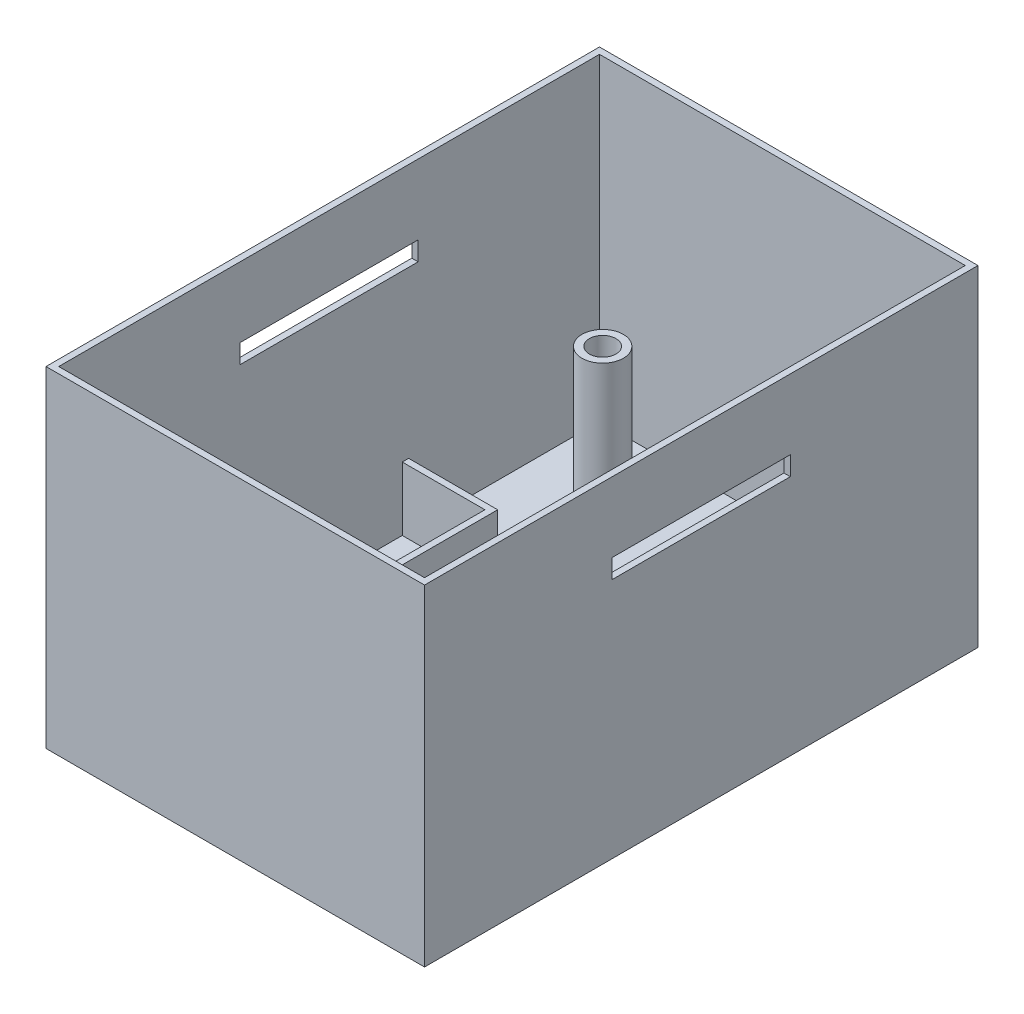
ISO-10303-21;
HEADER;
FILE_DESCRIPTION(('STEP AP214'),'2;1');
FILE_NAME('part.step','',(''),(''),'','','');
FILE_SCHEMA(('AUTOMOTIVE_DESIGN { 1 0 10303 214 1 1 1 1 }'));
ENDSEC;
DATA;
#1=APPLICATION_CONTEXT('core data for automotive mechanical design processes');
#2=APPLICATION_PROTOCOL_DEFINITION('international standard','automotive_design',2000,#1);
#3=PRODUCT_CONTEXT('',#1,'mechanical');
#4=PRODUCT('Part','Part','',(#3));
#5=PRODUCT_RELATED_PRODUCT_CATEGORY('part','',(#4));
#6=PRODUCT_DEFINITION_FORMATION('','',#4);
#7=PRODUCT_DEFINITION_CONTEXT('part definition',#1,'design');
#8=PRODUCT_DEFINITION('design','',#6,#7);
#9=PRODUCT_DEFINITION_SHAPE('','',#8);
#10=(LENGTH_UNIT() NAMED_UNIT(*) SI_UNIT(.MILLI.,.METRE.));
#11=(NAMED_UNIT(*) PLANE_ANGLE_UNIT() SI_UNIT($,.RADIAN.));
#12=(NAMED_UNIT(*) SI_UNIT($,.STERADIAN.) SOLID_ANGLE_UNIT());
#13=UNCERTAINTY_MEASURE_WITH_UNIT(LENGTH_MEASURE(1.E-05),#10,'distance_accuracy_value','');
#14=(GEOMETRIC_REPRESENTATION_CONTEXT(3) GLOBAL_UNCERTAINTY_ASSIGNED_CONTEXT((#13)) GLOBAL_UNIT_ASSIGNED_CONTEXT((#10,
#11,#12)) REPRESENTATION_CONTEXT('',''));
#15=CARTESIAN_POINT('',(0.,0.,0.));
#16=DIRECTION('',(0.,0.,1.));
#17=DIRECTION('',(1.,0.,0.));
#18=AXIS2_PLACEMENT_3D('',#15,#16,#17);
#19=CARTESIAN_POINT('',(-28.75,50.,0.));
#20=DIRECTION('',(-1.,0.,0.));
#21=DIRECTION('',(0.,0.,1.));
#22=AXIS2_PLACEMENT_3D('',#19,#20,#21);
#23=PLANE('',#22);
#24=DIRECTION('',(0.,1.,0.));
#25=VECTOR('',#24,1.);
#26=CARTESIAN_POINT('',(-28.75,50.,14.));
#27=LINE('',#26,#25);
#28=CARTESIAN_POINT('',(-28.75,36.,14.));
#29=VERTEX_POINT('',#28);
#30=CARTESIAN_POINT('',(-28.75,39.,14.));
#31=VERTEX_POINT('',#30);
#32=EDGE_CURVE('E258',#29,#31,#27,.T.);
#33=ORIENTED_EDGE('',*,*,#32,.T.);
#34=DIRECTION('',(0.,0.,-1.));
#35=VECTOR('',#34,1.);
#36=CARTESIAN_POINT('',(-28.75,39.,0.));
#37=LINE('',#36,#35);
#38=CARTESIAN_POINT('',(-28.75,39.,-14.));
#39=VERTEX_POINT('',#38);
#40=EDGE_CURVE('E264',#31,#39,#37,.T.);
#41=ORIENTED_EDGE('',*,*,#40,.T.);
#42=DIRECTION('',(0.,-1.,0.));
#43=VECTOR('',#42,1.);
#44=CARTESIAN_POINT('',(-28.75,50.,-14.));
#45=LINE('',#44,#43);
#46=CARTESIAN_POINT('',(-28.75,36.,-14.));
#47=VERTEX_POINT('',#46);
#48=EDGE_CURVE('E249',#39,#47,#45,.T.);
#49=ORIENTED_EDGE('',*,*,#48,.T.);
#50=DIRECTION('',(0.,0.,1.));
#51=VECTOR('',#50,1.);
#52=CARTESIAN_POINT('',(-28.75,36.,0.));
#53=LINE('',#52,#51);
#54=EDGE_CURVE('E220',#47,#29,#53,.T.);
#55=ORIENTED_EDGE('',*,*,#54,.T.);
#56=EDGE_LOOP('',(#33,#41,#49,#55));
#57=FACE_BOUND('',#56,.T.);
#58=DIRECTION('',(0.,-1.,0.));
#59=VECTOR('',#58,1.);
#60=CARTESIAN_POINT('',(-28.75,10.,34.5));
#61=LINE('',#60,#59);
#62=CARTESIAN_POINT('',(-28.75,10.,34.5));
#63=VERTEX_POINT('',#62);
#64=CARTESIAN_POINT('',(-28.75,0.,34.5));
#65=VERTEX_POINT('',#64);
#66=EDGE_CURVE('E347',#63,#65,#61,.T.);
#67=ORIENTED_EDGE('',*,*,#66,.T.);
#68=DIRECTION('',(0.,0.,-1.));
#69=VECTOR('',#68,1.);
#70=CARTESIAN_POINT('',(-28.75,0.,0.));
#71=LINE('',#70,#69);
#72=CARTESIAN_POINT('',(-28.75,0.,-11.5));
#73=VERTEX_POINT('',#72);
#74=EDGE_CURVE('E385',#65,#73,#71,.T.);
#75=ORIENTED_EDGE('',*,*,#74,.T.);
#76=DIRECTION('',(0.,-1.,0.));
#77=VECTOR('',#76,1.);
#78=CARTESIAN_POINT('',(-28.75,10.,-11.5));
#79=LINE('',#78,#77);
#80=CARTESIAN_POINT('',(-28.75,10.,-11.5));
#81=VERTEX_POINT('',#80);
#82=EDGE_CURVE('E334',#81,#73,#79,.T.);
#83=ORIENTED_EDGE('',*,*,#82,.F.);
#84=DIRECTION('',(0.,0.,-1.));
#85=VECTOR('',#84,1.);
#86=CARTESIAN_POINT('',(-28.75,10.,0.));
#87=LINE('',#86,#85);
#88=CARTESIAN_POINT('',(-28.75,10.,-12.5));
#89=VERTEX_POINT('',#88);
#90=EDGE_CURVE('E313',#81,#89,#87,.T.);
#91=ORIENTED_EDGE('',*,*,#90,.T.);
#92=DIRECTION('',(0.,-1.,0.));
#93=VECTOR('',#92,1.);
#94=CARTESIAN_POINT('',(-28.75,10.,-12.5));
#95=LINE('',#94,#93);
#96=CARTESIAN_POINT('',(-28.75,0.,-12.5));
#97=VERTEX_POINT('',#96);
#98=EDGE_CURVE('E336',#89,#97,#95,.T.);
#99=ORIENTED_EDGE('',*,*,#98,.T.);
#100=CARTESIAN_POINT('',(-28.75,0.,-42.5));
#101=VERTEX_POINT('',#100);
#102=EDGE_CURVE('E382',#97,#101,#71,.T.);
#103=ORIENTED_EDGE('',*,*,#102,.T.);
#104=DIRECTION('',(0.,-1.,0.));
#105=VECTOR('',#104,1.);
#106=CARTESIAN_POINT('',(-28.75,50.,-42.5));
#107=LINE('',#106,#105);
#108=CARTESIAN_POINT('',(-28.75,50.,-42.5));
#109=VERTEX_POINT('',#108);
#110=EDGE_CURVE('E399',#109,#101,#107,.T.);
#111=ORIENTED_EDGE('',*,*,#110,.F.);
#112=DIRECTION('',(0.,0.,-1.));
#113=VECTOR('',#112,1.);
#114=CARTESIAN_POINT('',(-28.75,50.,0.));
#115=LINE('',#114,#113);
#116=CARTESIAN_POINT('',(-28.75,50.,42.5));
#117=VERTEX_POINT('',#116);
#118=EDGE_CURVE('E361',#117,#109,#115,.T.);
#119=ORIENTED_EDGE('',*,*,#118,.F.);
#120=DIRECTION('',(0.,-1.,0.));
#121=VECTOR('',#120,1.);
#122=CARTESIAN_POINT('',(-28.75,50.,42.5));
#123=LINE('',#122,#121);
#124=CARTESIAN_POINT('',(-28.75,0.,42.5));
#125=VERTEX_POINT('',#124);
#126=EDGE_CURVE('E402',#117,#125,#123,.T.);
#127=ORIENTED_EDGE('',*,*,#126,.T.);
#128=CARTESIAN_POINT('',(-28.75,0.,35.5));
#129=VERTEX_POINT('',#128);
#130=EDGE_CURVE('E383',#125,#129,#71,.T.);
#131=ORIENTED_EDGE('',*,*,#130,.T.);
#132=DIRECTION('',(0.,-1.,0.));
#133=VECTOR('',#132,1.);
#134=CARTESIAN_POINT('',(-28.75,10.,35.5));
#135=LINE('',#134,#133);
#136=CARTESIAN_POINT('',(-28.75,10.,35.5));
#137=VERTEX_POINT('',#136);
#138=EDGE_CURVE('E344',#137,#129,#135,.T.);
#139=ORIENTED_EDGE('',*,*,#138,.F.);
#140=EDGE_CURVE('E310',#137,#63,#87,.T.);
#141=ORIENTED_EDGE('',*,*,#140,.T.);
#142=EDGE_LOOP('',(#67,#75,#83,#91,#99,#103,#111,#119,#127,#131,#139,#141));
#143=FACE_BOUND('',#142,.T.);
#144=ADVANCED_FACE('F53',(#57,#143),#23,.F.);
#145=CARTESIAN_POINT('',(-29.75,50.,0.));
#146=DIRECTION('',(-1.,0.,0.));
#147=DIRECTION('',(0.,0.,1.));
#148=AXIS2_PLACEMENT_3D('',#145,#146,#147);
#149=PLANE('',#148);
#150=DIRECTION('',(0.,0.,-1.));
#151=VECTOR('',#150,1.);
#152=CARTESIAN_POINT('',(-29.75,39.,0.));
#153=LINE('',#152,#151);
#154=CARTESIAN_POINT('',(-29.75,39.,14.));
#155=VERTEX_POINT('',#154);
#156=CARTESIAN_POINT('',(-29.75,39.,-14.));
#157=VERTEX_POINT('',#156);
#158=EDGE_CURVE('E76',#155,#157,#153,.T.);
#159=ORIENTED_EDGE('',*,*,#158,.F.);
#160=DIRECTION('',(0.,1.,0.));
#161=VECTOR('',#160,1.);
#162=CARTESIAN_POINT('',(-29.75,39.,14.));
#163=LINE('',#162,#161);
#164=CARTESIAN_POINT('',(-29.75,36.,14.));
#165=VERTEX_POINT('',#164);
#166=EDGE_CURVE('E234',#165,#155,#163,.T.);
#167=ORIENTED_EDGE('',*,*,#166,.F.);
#168=DIRECTION('',(0.,0.,1.));
#169=VECTOR('',#168,1.);
#170=CARTESIAN_POINT('',(-29.75,36.,14.));
#171=LINE('',#170,#169);
#172=CARTESIAN_POINT('',(-29.75,36.,-14.));
#173=VERTEX_POINT('',#172);
#174=EDGE_CURVE('E217',#173,#165,#171,.T.);
#175=ORIENTED_EDGE('',*,*,#174,.F.);
#176=DIRECTION('',(0.,-1.,0.));
#177=VECTOR('',#176,1.);
#178=CARTESIAN_POINT('',(-29.75,36.,-14.));
#179=LINE('',#178,#177);
#180=EDGE_CURVE('E226',#157,#173,#179,.T.);
#181=ORIENTED_EDGE('',*,*,#180,.F.);
#182=EDGE_LOOP('',(#159,#167,#175,#181));
#183=FACE_BOUND('',#182,.T.);
#184=DIRECTION('',(0.,-1.,0.));
#185=VECTOR('',#184,1.);
#186=CARTESIAN_POINT('',(-29.75,50.,-43.5));
#187=LINE('',#186,#185);
#188=CARTESIAN_POINT('',(-29.75,50.,-43.5));
#189=VERTEX_POINT('',#188);
#190=CARTESIAN_POINT('',(-29.75,-2.,-43.5));
#191=VERTEX_POINT('',#190);
#192=EDGE_CURVE('E388',#189,#191,#187,.T.);
#193=ORIENTED_EDGE('',*,*,#192,.T.);
#194=DIRECTION('',(0.,0.,-1.));
#195=VECTOR('',#194,1.);
#196=CARTESIAN_POINT('',(-29.75,-2.,43.5));
#197=LINE('',#196,#195);
#198=CARTESIAN_POINT('',(-29.75,-2.,43.5));
#199=VERTEX_POINT('',#198);
#200=EDGE_CURVE('E296',#199,#191,#197,.T.);
#201=ORIENTED_EDGE('',*,*,#200,.F.);
#202=DIRECTION('',(0.,-1.,0.));
#203=VECTOR('',#202,1.);
#204=CARTESIAN_POINT('',(-29.75,50.,43.5));
#205=LINE('',#204,#203);
#206=CARTESIAN_POINT('',(-29.75,50.,43.5));
#207=VERTEX_POINT('',#206);
#208=EDGE_CURVE('E395',#207,#199,#205,.T.);
#209=ORIENTED_EDGE('',*,*,#208,.F.);
#210=DIRECTION('',(0.,0.,-1.));
#211=VECTOR('',#210,1.);
#212=CARTESIAN_POINT('',(-29.75,50.,0.));
#213=LINE('',#212,#211);
#214=EDGE_CURVE('E365',#207,#189,#213,.T.);
#215=ORIENTED_EDGE('',*,*,#214,.T.);
#216=EDGE_LOOP('',(#193,#201,#209,#215));
#217=FACE_BOUND('',#216,.T.);
#218=ADVANCED_FACE('F231',(#183,#217),#149,.T.);
#219=CARTESIAN_POINT('',(0.,50.,43.5));
#220=DIRECTION('',(0.,0.,-1.));
#221=DIRECTION('',(-1.,0.,0.));
#222=AXIS2_PLACEMENT_3D('',#219,#220,#221);
#223=PLANE('',#222);
#224=ORIENTED_EDGE('',*,*,#208,.T.);
#225=DIRECTION('',(1.,0.,0.));
#226=VECTOR('',#225,1.);
#227=CARTESIAN_POINT('',(-29.75,-2.,43.5));
#228=LINE('',#227,#226);
#229=CARTESIAN_POINT('',(29.75,-2.,43.5));
#230=VERTEX_POINT('',#229);
#231=EDGE_CURVE('E293',#199,#230,#228,.T.);
#232=ORIENTED_EDGE('',*,*,#231,.T.);
#233=DIRECTION('',(0.,-1.,0.));
#234=VECTOR('',#233,1.);
#235=CARTESIAN_POINT('',(29.75,50.,43.5));
#236=LINE('',#235,#234);
#237=CARTESIAN_POINT('',(29.75,50.,43.5));
#238=VERTEX_POINT('',#237);
#239=EDGE_CURVE('E393',#238,#230,#236,.T.);
#240=ORIENTED_EDGE('',*,*,#239,.F.);
#241=DIRECTION('',(1.,0.,0.));
#242=VECTOR('',#241,1.);
#243=CARTESIAN_POINT('',(0.,50.,43.5));
#244=LINE('',#243,#242);
#245=EDGE_CURVE('E368',#207,#238,#244,.T.);
#246=ORIENTED_EDGE('',*,*,#245,.F.);
#247=EDGE_LOOP('',(#224,#232,#240,#246));
#248=FACE_BOUND('',#247,.T.);
#249=ADVANCED_FACE('F437',(#248),#223,.F.);
#250=CARTESIAN_POINT('',(29.75,50.,0.));
#251=DIRECTION('',(-1.,0.,0.));
#252=DIRECTION('',(0.,0.,1.));
#253=AXIS2_PLACEMENT_3D('',#250,#251,#252);
#254=PLANE('',#253);
#255=DIRECTION('',(0.,1.,0.));
#256=VECTOR('',#255,1.);
#257=CARTESIAN_POINT('',(29.75,50.,14.));
#258=LINE('',#257,#256);
#259=CARTESIAN_POINT('',(29.75,36.,14.));
#260=VERTEX_POINT('',#259);
#261=CARTESIAN_POINT('',(29.75,39.,14.));
#262=VERTEX_POINT('',#261);
#263=EDGE_CURVE('E255',#260,#262,#258,.T.);
#264=ORIENTED_EDGE('',*,*,#263,.T.);
#265=DIRECTION('',(0.,0.,-1.));
#266=VECTOR('',#265,1.);
#267=CARTESIAN_POINT('',(29.75,39.,0.));
#268=LINE('',#267,#266);
#269=CARTESIAN_POINT('',(29.75,39.,-14.));
#270=VERTEX_POINT('',#269);
#271=EDGE_CURVE('E261',#262,#270,#268,.T.);
#272=ORIENTED_EDGE('',*,*,#271,.T.);
#273=DIRECTION('',(0.,-1.,0.));
#274=VECTOR('',#273,1.);
#275=CARTESIAN_POINT('',(29.75,50.,-14.));
#276=LINE('',#275,#274);
#277=CARTESIAN_POINT('',(29.75,36.,-14.));
#278=VERTEX_POINT('',#277);
#279=EDGE_CURVE('E246',#270,#278,#276,.T.);
#280=ORIENTED_EDGE('',*,*,#279,.T.);
#281=DIRECTION('',(0.,0.,1.));
#282=VECTOR('',#281,1.);
#283=CARTESIAN_POINT('',(29.75,36.,0.));
#284=LINE('',#283,#282);
#285=EDGE_CURVE('E251',#278,#260,#284,.T.);
#286=ORIENTED_EDGE('',*,*,#285,.T.);
#287=EDGE_LOOP('',(#264,#272,#280,#286));
#288=FACE_BOUND('',#287,.T.);
#289=ORIENTED_EDGE('',*,*,#239,.T.);
#290=DIRECTION('',(0.,0.,-1.));
#291=VECTOR('',#290,1.);
#292=CARTESIAN_POINT('',(29.75,-2.,43.5));
#293=LINE('',#292,#291);
#294=CARTESIAN_POINT('',(29.75,-2.,-43.5));
#295=VERTEX_POINT('',#294);
#296=EDGE_CURVE('E290',#230,#295,#293,.T.);
#297=ORIENTED_EDGE('',*,*,#296,.T.);
#298=DIRECTION('',(0.,-1.,0.));
#299=VECTOR('',#298,1.);
#300=CARTESIAN_POINT('',(29.75,50.,-43.5));
#301=LINE('',#300,#299);
#302=CARTESIAN_POINT('',(29.75,50.,-43.5));
#303=VERTEX_POINT('',#302);
#304=EDGE_CURVE('E390',#303,#295,#301,.T.);
#305=ORIENTED_EDGE('',*,*,#304,.F.);
#306=DIRECTION('',(0.,0.,-1.));
#307=VECTOR('',#306,1.);
#308=CARTESIAN_POINT('',(29.75,50.,0.));
#309=LINE('',#308,#307);
#310=EDGE_CURVE('E371',#238,#303,#309,.T.);
#311=ORIENTED_EDGE('',*,*,#310,.F.);
#312=EDGE_LOOP('',(#289,#297,#305,#311));
#313=FACE_BOUND('',#312,.T.);
#314=ADVANCED_FACE('F434',(#288,#313),#254,.F.);
#315=CARTESIAN_POINT('',(28.75,50.,0.));
#316=DIRECTION('',(-1.,0.,0.));
#317=DIRECTION('',(0.,0.,1.));
#318=AXIS2_PLACEMENT_3D('',#315,#316,#317);
#319=PLANE('',#318);
#320=DIRECTION('',(0.,0.,-1.));
#321=VECTOR('',#320,1.);
#322=CARTESIAN_POINT('',(28.75,39.,0.));
#323=LINE('',#322,#321);
#324=CARTESIAN_POINT('',(28.75,39.,14.));
#325=VERTEX_POINT('',#324);
#326=CARTESIAN_POINT('',(28.75,39.,-14.));
#327=VERTEX_POINT('',#326);
#328=EDGE_CURVE('E12',#325,#327,#323,.T.);
#329=ORIENTED_EDGE('',*,*,#328,.F.);
#330=DIRECTION('',(0.,1.,0.));
#331=VECTOR('',#330,1.);
#332=CARTESIAN_POINT('',(28.75,50.,14.));
#333=LINE('',#332,#331);
#334=CARTESIAN_POINT('',(28.75,36.,14.));
#335=VERTEX_POINT('',#334);
#336=EDGE_CURVE('E61',#335,#325,#333,.T.);
#337=ORIENTED_EDGE('',*,*,#336,.F.);
#338=DIRECTION('',(0.,0.,1.));
#339=VECTOR('',#338,1.);
#340=CARTESIAN_POINT('',(28.75,36.,0.));
#341=LINE('',#340,#339);
#342=CARTESIAN_POINT('',(28.75,36.,-14.));
#343=VERTEX_POINT('',#342);
#344=EDGE_CURVE('E411',#343,#335,#341,.T.);
#345=ORIENTED_EDGE('',*,*,#344,.F.);
#346=DIRECTION('',(0.,-1.,0.));
#347=VECTOR('',#346,1.);
#348=CARTESIAN_POINT('',(28.75,50.,-14.));
#349=LINE('',#348,#347);
#350=EDGE_CURVE('E397',#327,#343,#349,.T.);
#351=ORIENTED_EDGE('',*,*,#350,.F.);
#352=EDGE_LOOP('',(#329,#337,#345,#351));
#353=FACE_BOUND('',#352,.T.);
#354=DIRECTION('',(0.,0.,-1.));
#355=VECTOR('',#354,1.);
#356=CARTESIAN_POINT('',(28.75,0.,0.));
#357=LINE('',#356,#355);
#358=CARTESIAN_POINT('',(28.75,0.,42.5));
#359=VERTEX_POINT('',#358);
#360=CARTESIAN_POINT('',(28.75,0.,-42.5));
#361=VERTEX_POINT('',#360);
#362=EDGE_CURVE('E353',#359,#361,#357,.T.);
#363=ORIENTED_EDGE('',*,*,#362,.F.);
#364=DIRECTION('',(0.,-1.,0.));
#365=VECTOR('',#364,1.);
#366=CARTESIAN_POINT('',(28.75,50.,42.5));
#367=LINE('',#366,#365);
#368=CARTESIAN_POINT('',(28.75,50.,42.5));
#369=VERTEX_POINT('',#368);
#370=EDGE_CURVE('E391',#369,#359,#367,.T.);
#371=ORIENTED_EDGE('',*,*,#370,.F.);
#372=DIRECTION('',(0.,0.,-1.));
#373=VECTOR('',#372,1.);
#374=CARTESIAN_POINT('',(28.75,50.,0.));
#375=LINE('',#374,#373);
#376=CARTESIAN_POINT('',(28.75,50.,-42.5));
#377=VERTEX_POINT('',#376);
#378=EDGE_CURVE('E354',#369,#377,#375,.T.);
#379=ORIENTED_EDGE('',*,*,#378,.T.);
#380=DIRECTION('',(0.,-1.,0.));
#381=VECTOR('',#380,1.);
#382=CARTESIAN_POINT('',(28.75,50.,-42.5));
#383=LINE('',#382,#381);
#384=EDGE_CURVE('E376',#377,#361,#383,.T.);
#385=ORIENTED_EDGE('',*,*,#384,.T.);
#386=EDGE_LOOP('',(#363,#371,#379,#385));
#387=FACE_BOUND('',#386,.T.);
#388=ADVANCED_FACE('F55',(#353,#387),#319,.T.);
#389=CARTESIAN_POINT('',(0.,50.,42.5));
#390=DIRECTION('',(0.,0.,-1.));
#391=DIRECTION('',(-1.,0.,0.));
#392=AXIS2_PLACEMENT_3D('',#389,#390,#391);
#393=PLANE('',#392);
#394=DIRECTION('',(1.,0.,0.));
#395=VECTOR('',#394,1.);
#396=CARTESIAN_POINT('',(0.,0.,42.5));
#397=LINE('',#396,#395);
#398=EDGE_CURVE('E379',#125,#359,#397,.T.);
#399=ORIENTED_EDGE('',*,*,#398,.F.);
#400=ORIENTED_EDGE('',*,*,#126,.F.);
#401=DIRECTION('',(1.,0.,0.));
#402=VECTOR('',#401,1.);
#403=CARTESIAN_POINT('',(0.,50.,42.5));
#404=LINE('',#403,#402);
#405=EDGE_CURVE('E357',#117,#369,#404,.T.);
#406=ORIENTED_EDGE('',*,*,#405,.T.);
#407=ORIENTED_EDGE('',*,*,#370,.T.);
#408=EDGE_LOOP('',(#399,#400,#406,#407));
#409=FACE_BOUND('',#408,.T.);
#410=ADVANCED_FACE('F480',(#409),#393,.T.);
#411=CARTESIAN_POINT('',(0.,50.,-42.5));
#412=DIRECTION('',(0.,0.,-1.));
#413=DIRECTION('',(-1.,0.,0.));
#414=AXIS2_PLACEMENT_3D('',#411,#412,#413);
#415=PLANE('',#414);
#416=DIRECTION('',(1.,0.,0.));
#417=VECTOR('',#416,1.);
#418=CARTESIAN_POINT('',(0.,0.,-42.5));
#419=LINE('',#418,#417);
#420=EDGE_CURVE('E358',#101,#361,#419,.T.);
#421=ORIENTED_EDGE('',*,*,#420,.T.);
#422=ORIENTED_EDGE('',*,*,#384,.F.);
#423=DIRECTION('',(1.,0.,0.));
#424=VECTOR('',#423,1.);
#425=CARTESIAN_POINT('',(0.,50.,-42.5));
#426=LINE('',#425,#424);
#427=EDGE_CURVE('E363',#109,#377,#426,.T.);
#428=ORIENTED_EDGE('',*,*,#427,.F.);
#429=ORIENTED_EDGE('',*,*,#110,.T.);
#430=EDGE_LOOP('',(#421,#422,#428,#429));
#431=FACE_BOUND('',#430,.T.);
#432=ADVANCED_FACE('F467',(#431),#415,.F.);
#433=CARTESIAN_POINT('',(0.,50.,-43.5));
#434=DIRECTION('',(0.,0.,-1.));
#435=DIRECTION('',(-1.,0.,0.));
#436=AXIS2_PLACEMENT_3D('',#433,#434,#435);
#437=PLANE('',#436);
#438=ORIENTED_EDGE('',*,*,#304,.T.);
#439=DIRECTION('',(1.,0.,0.));
#440=VECTOR('',#439,1.);
#441=CARTESIAN_POINT('',(-29.75,-2.,-43.5));
#442=LINE('',#441,#440);
#443=EDGE_CURVE('E287',#191,#295,#442,.T.);
#444=ORIENTED_EDGE('',*,*,#443,.F.);
#445=ORIENTED_EDGE('',*,*,#192,.F.);
#446=DIRECTION('',(1.,0.,0.));
#447=VECTOR('',#446,1.);
#448=CARTESIAN_POINT('',(0.,50.,-43.5));
#449=LINE('',#448,#447);
#450=EDGE_CURVE('E373',#189,#303,#449,.T.);
#451=ORIENTED_EDGE('',*,*,#450,.T.);
#452=EDGE_LOOP('',(#438,#444,#445,#451));
#453=FACE_BOUND('',#452,.T.);
#454=ADVANCED_FACE('F451',(#453),#437,.T.);
#455=CARTESIAN_POINT('',(0.,50.,0.));
#456=DIRECTION('',(0.,1.,0.));
#457=DIRECTION('',(0.,0.,1.));
#458=AXIS2_PLACEMENT_3D('',#455,#456,#457);
#459=PLANE('',#458);
#460=ORIENTED_EDGE('',*,*,#378,.F.);
#461=ORIENTED_EDGE('',*,*,#405,.F.);
#462=ORIENTED_EDGE('',*,*,#118,.T.);
#463=ORIENTED_EDGE('',*,*,#427,.T.);
#464=EDGE_LOOP('',(#460,#461,#462,#463));
#465=FACE_BOUND('',#464,.T.);
#466=ORIENTED_EDGE('',*,*,#214,.F.);
#467=ORIENTED_EDGE('',*,*,#245,.T.);
#468=ORIENTED_EDGE('',*,*,#310,.T.);
#469=ORIENTED_EDGE('',*,*,#450,.F.);
#470=EDGE_LOOP('',(#466,#467,#468,#469));
#471=FACE_BOUND('',#470,.T.);
#472=ADVANCED_FACE('F454',(#465,#471),#459,.T.);
#473=CARTESIAN_POINT('',(0.,10.,-11.5));
#474=DIRECTION('',(0.,0.,1.));
#475=DIRECTION('',(1.,0.,0.));
#476=AXIS2_PLACEMENT_3D('',#473,#474,#475);
#477=PLANE('',#476);
#478=DIRECTION('',(-1.,0.,0.));
#479=VECTOR('',#478,1.);
#480=CARTESIAN_POINT('',(0.,0.,-11.5));
#481=LINE('',#480,#479);
#482=CARTESIAN_POINT('',(-15.75,0.,-11.5));
#483=VERTEX_POINT('',#482);
#484=EDGE_CURVE('E299',#483,#73,#481,.T.);
#485=ORIENTED_EDGE('',*,*,#484,.F.);
#486=DIRECTION('',(0.,-1.,0.));
#487=VECTOR('',#486,1.);
#488=CARTESIAN_POINT('',(-15.75,10.,-11.5));
#489=LINE('',#488,#487);
#490=CARTESIAN_POINT('',(-15.75,10.,-11.5));
#491=VERTEX_POINT('',#490);
#492=EDGE_CURVE('E351',#491,#483,#489,.T.);
#493=ORIENTED_EDGE('',*,*,#492,.F.);
#494=DIRECTION('',(-1.,0.,0.));
#495=VECTOR('',#494,1.);
#496=CARTESIAN_POINT('',(0.,10.,-11.5));
#497=LINE('',#496,#495);
#498=EDGE_CURVE('E300',#491,#81,#497,.T.);
#499=ORIENTED_EDGE('',*,*,#498,.T.);
#500=ORIENTED_EDGE('',*,*,#82,.T.);
#501=EDGE_LOOP('',(#485,#493,#499,#500));
#502=FACE_BOUND('',#501,.T.);
#503=ADVANCED_FACE('F456',(#502),#477,.T.);
#504=CARTESIAN_POINT('',(-15.75,10.,0.));
#505=DIRECTION('',(-1.,0.,0.));
#506=DIRECTION('',(0.,0.,1.));
#507=AXIS2_PLACEMENT_3D('',#504,#505,#506);
#508=PLANE('',#507);
#509=DIRECTION('',(0.,0.,-1.));
#510=VECTOR('',#509,1.);
#511=CARTESIAN_POINT('',(-15.75,0.,0.));
#512=LINE('',#511,#510);
#513=CARTESIAN_POINT('',(-15.75,0.,34.5));
#514=VERTEX_POINT('',#513);
#515=EDGE_CURVE('E322',#514,#483,#512,.T.);
#516=ORIENTED_EDGE('',*,*,#515,.F.);
#517=DIRECTION('',(0.,-1.,0.));
#518=VECTOR('',#517,1.);
#519=CARTESIAN_POINT('',(-15.75,10.,34.5));
#520=LINE('',#519,#518);
#521=CARTESIAN_POINT('',(-15.75,10.,34.5));
#522=VERTEX_POINT('',#521);
#523=EDGE_CURVE('E349',#522,#514,#520,.T.);
#524=ORIENTED_EDGE('',*,*,#523,.F.);
#525=DIRECTION('',(0.,0.,-1.));
#526=VECTOR('',#525,1.);
#527=CARTESIAN_POINT('',(-15.75,10.,0.));
#528=LINE('',#527,#526);
#529=EDGE_CURVE('E303',#522,#491,#528,.T.);
#530=ORIENTED_EDGE('',*,*,#529,.T.);
#531=ORIENTED_EDGE('',*,*,#492,.T.);
#532=EDGE_LOOP('',(#516,#524,#530,#531));
#533=FACE_BOUND('',#532,.T.);
#534=ADVANCED_FACE('F463',(#533),#508,.T.);
#535=CARTESIAN_POINT('',(0.,10.,34.5));
#536=DIRECTION('',(0.,0.,1.));
#537=DIRECTION('',(1.,0.,0.));
#538=AXIS2_PLACEMENT_3D('',#535,#536,#537);
#539=PLANE('',#538);
#540=DIRECTION('',(-1.,0.,0.));
#541=VECTOR('',#540,1.);
#542=CARTESIAN_POINT('',(0.,0.,34.5));
#543=LINE('',#542,#541);
#544=EDGE_CURVE('E325',#514,#65,#543,.T.);
#545=ORIENTED_EDGE('',*,*,#544,.T.);
#546=ORIENTED_EDGE('',*,*,#66,.F.);
#547=DIRECTION('',(-1.,0.,0.));
#548=VECTOR('',#547,1.);
#549=CARTESIAN_POINT('',(0.,10.,34.5));
#550=LINE('',#549,#548);
#551=EDGE_CURVE('E307',#522,#63,#550,.T.);
#552=ORIENTED_EDGE('',*,*,#551,.F.);
#553=ORIENTED_EDGE('',*,*,#523,.T.);
#554=EDGE_LOOP('',(#545,#546,#552,#553));
#555=FACE_BOUND('',#554,.T.);
#556=ADVANCED_FACE('F512',(#555),#539,.F.);
#557=CARTESIAN_POINT('',(0.,10.,35.5));
#558=DIRECTION('',(0.,0.,-1.));
#559=DIRECTION('',(-1.,0.,0.));
#560=AXIS2_PLACEMENT_3D('',#557,#558,#559);
#561=PLANE('',#560);
#562=DIRECTION('',(1.,0.,0.));
#563=VECTOR('',#562,1.);
#564=CARTESIAN_POINT('',(0.,0.,35.5));
#565=LINE('',#564,#563);
#566=CARTESIAN_POINT('',(-14.75,0.,35.5));
#567=VERTEX_POINT('',#566);
#568=EDGE_CURVE('E328',#129,#567,#565,.T.);
#569=ORIENTED_EDGE('',*,*,#568,.T.);
#570=DIRECTION('',(0.,-1.,0.));
#571=VECTOR('',#570,1.);
#572=CARTESIAN_POINT('',(-14.75,10.,35.5));
#573=LINE('',#572,#571);
#574=CARTESIAN_POINT('',(-14.75,10.,35.5));
#575=VERTEX_POINT('',#574);
#576=EDGE_CURVE('E341',#575,#567,#573,.T.);
#577=ORIENTED_EDGE('',*,*,#576,.F.);
#578=DIRECTION('',(1.,0.,0.));
#579=VECTOR('',#578,1.);
#580=CARTESIAN_POINT('',(0.,10.,35.5));
#581=LINE('',#580,#579);
#582=EDGE_CURVE('E312',#137,#575,#581,.T.);
#583=ORIENTED_EDGE('',*,*,#582,.F.);
#584=ORIENTED_EDGE('',*,*,#138,.T.);
#585=EDGE_LOOP('',(#569,#577,#583,#584));
#586=FACE_BOUND('',#585,.T.);
#587=ADVANCED_FACE('F498',(#586),#561,.F.);
#588=CARTESIAN_POINT('',(-14.75,10.,0.));
#589=DIRECTION('',(-1.,0.,0.));
#590=DIRECTION('',(0.,0.,1.));
#591=AXIS2_PLACEMENT_3D('',#588,#589,#590);
#592=PLANE('',#591);
#593=DIRECTION('',(0.,0.,-1.));
#594=VECTOR('',#593,1.);
#595=CARTESIAN_POINT('',(-14.75,0.,0.));
#596=LINE('',#595,#594);
#597=CARTESIAN_POINT('',(-14.75,0.,-12.5));
#598=VERTEX_POINT('',#597);
#599=EDGE_CURVE('E330',#567,#598,#596,.T.);
#600=ORIENTED_EDGE('',*,*,#599,.T.);
#601=DIRECTION('',(0.,-1.,0.));
#602=VECTOR('',#601,1.);
#603=CARTESIAN_POINT('',(-14.75,10.,-12.5));
#604=LINE('',#603,#602);
#605=CARTESIAN_POINT('',(-14.75,10.,-12.5));
#606=VERTEX_POINT('',#605);
#607=EDGE_CURVE('E338',#606,#598,#604,.T.);
#608=ORIENTED_EDGE('',*,*,#607,.F.);
#609=DIRECTION('',(0.,0.,-1.));
#610=VECTOR('',#609,1.);
#611=CARTESIAN_POINT('',(-14.75,10.,0.));
#612=LINE('',#611,#610);
#613=EDGE_CURVE('E315',#575,#606,#612,.T.);
#614=ORIENTED_EDGE('',*,*,#613,.F.);
#615=ORIENTED_EDGE('',*,*,#576,.T.);
#616=EDGE_LOOP('',(#600,#608,#614,#615));
#617=FACE_BOUND('',#616,.T.);
#618=ADVANCED_FACE('F530',(#617),#592,.F.);
#619=CARTESIAN_POINT('',(0.,10.,-12.5));
#620=DIRECTION('',(0.,0.,1.));
#621=DIRECTION('',(1.,0.,0.));
#622=AXIS2_PLACEMENT_3D('',#619,#620,#621);
#623=PLANE('',#622);
#624=DIRECTION('',(-1.,0.,0.));
#625=VECTOR('',#624,1.);
#626=CARTESIAN_POINT('',(0.,0.,-12.5));
#627=LINE('',#626,#625);
#628=EDGE_CURVE('E304',#598,#97,#627,.T.);
#629=ORIENTED_EDGE('',*,*,#628,.T.);
#630=ORIENTED_EDGE('',*,*,#98,.F.);
#631=DIRECTION('',(-1.,0.,0.));
#632=VECTOR('',#631,1.);
#633=CARTESIAN_POINT('',(0.,10.,-12.5));
#634=LINE('',#633,#632);
#635=EDGE_CURVE('E317',#606,#89,#634,.T.);
#636=ORIENTED_EDGE('',*,*,#635,.F.);
#637=ORIENTED_EDGE('',*,*,#607,.T.);
#638=EDGE_LOOP('',(#629,#630,#636,#637));
#639=FACE_BOUND('',#638,.T.);
#640=ADVANCED_FACE('F526',(#639),#623,.F.);
#641=CARTESIAN_POINT('',(0.,10.,0.));
#642=DIRECTION('',(0.,1.,0.));
#643=DIRECTION('',(0.,0.,1.));
#644=AXIS2_PLACEMENT_3D('',#641,#642,#643);
#645=PLANE('',#644);
#646=ORIENTED_EDGE('',*,*,#498,.F.);
#647=ORIENTED_EDGE('',*,*,#529,.F.);
#648=ORIENTED_EDGE('',*,*,#551,.T.);
#649=ORIENTED_EDGE('',*,*,#140,.F.);
#650=ORIENTED_EDGE('',*,*,#582,.T.);
#651=ORIENTED_EDGE('',*,*,#613,.T.);
#652=ORIENTED_EDGE('',*,*,#635,.T.);
#653=ORIENTED_EDGE('',*,*,#90,.F.);
#654=EDGE_LOOP('',(#646,#647,#648,#649,#650,#651,#652,#653));
#655=FACE_BOUND('',#654,.T.);
#656=ADVANCED_FACE('F504',(#655),#645,.T.);
#657=CARTESIAN_POINT('',(0.,0.,0.));
#658=DIRECTION('',(0.,1.,0.));
#659=DIRECTION('',(0.,0.,1.));
#660=AXIS2_PLACEMENT_3D('',#657,#658,#659);
#661=PLANE('',#660);
#662=CARTESIAN_POINT('',(19.75,0.,20.));
#663=DIRECTION('',(0.,1.,0.));
#664=DIRECTION('',(0.,0.,1.));
#665=AXIS2_PLACEMENT_3D('',#662,#663,#664);
#666=CIRCLE('',#665,3.25);
#667=CARTESIAN_POINT('',(19.75,0.,23.25));
#668=VERTEX_POINT('',#667);
#669=EDGE_CURVE('E271',#668,#668,#666,.T.);
#670=ORIENTED_EDGE('',*,*,#669,.F.);
#671=EDGE_LOOP('',(#670));
#672=FACE_BOUND('',#671,.T.);
#673=CARTESIAN_POINT('',(-18.75,0.,-33.));
#674=DIRECTION('',(0.,1.,0.));
#675=DIRECTION('',(0.,0.,1.));
#676=AXIS2_PLACEMENT_3D('',#673,#674,#675);
#677=CIRCLE('',#676,3.25);
#678=CARTESIAN_POINT('',(-18.75,0.,-29.75));
#679=VERTEX_POINT('',#678);
#680=EDGE_CURVE('E279',#679,#679,#677,.T.);
#681=ORIENTED_EDGE('',*,*,#680,.F.);
#682=EDGE_LOOP('',(#681));
#683=FACE_BOUND('',#682,.T.);
#684=ORIENTED_EDGE('',*,*,#398,.T.);
#685=ORIENTED_EDGE('',*,*,#362,.T.);
#686=ORIENTED_EDGE('',*,*,#420,.F.);
#687=ORIENTED_EDGE('',*,*,#102,.F.);
#688=ORIENTED_EDGE('',*,*,#628,.F.);
#689=ORIENTED_EDGE('',*,*,#599,.F.);
#690=ORIENTED_EDGE('',*,*,#568,.F.);
#691=ORIENTED_EDGE('',*,*,#130,.F.);
#692=EDGE_LOOP('',(#684,#685,#686,#687,#688,#689,#690,#691));
#693=FACE_BOUND('',#692,.T.);
#694=ADVANCED_FACE('F494',(#672,#683,#693),#661,.T.);
#695=ORIENTED_EDGE('',*,*,#74,.F.);
#696=ORIENTED_EDGE('',*,*,#544,.F.);
#697=ORIENTED_EDGE('',*,*,#515,.T.);
#698=ORIENTED_EDGE('',*,*,#484,.T.);
#699=EDGE_LOOP('',(#695,#696,#697,#698));
#700=FACE_BOUND('',#699,.T.);
#701=ADVANCED_FACE('F515',(#700),#661,.T.);
#702=CARTESIAN_POINT('',(0.,-2.,0.));
#703=DIRECTION('',(0.,1.,0.));
#704=DIRECTION('',(0.,0.,1.));
#705=AXIS2_PLACEMENT_3D('',#702,#703,#704);
#706=PLANE('',#705);
#707=CARTESIAN_POINT('',(-18.75,-2.,-33.));
#708=DIRECTION('',(0.,1.,0.));
#709=DIRECTION('',(0.,0.,1.));
#710=AXIS2_PLACEMENT_3D('',#707,#708,#709);
#711=CIRCLE('',#710,2.1);
#712=CARTESIAN_POINT('',(-18.75,-2.,-30.9));
#713=VERTEX_POINT('',#712);
#714=EDGE_CURVE('E272',#713,#713,#711,.T.);
#715=ORIENTED_EDGE('',*,*,#714,.T.);
#716=EDGE_LOOP('',(#715));
#717=FACE_BOUND('',#716,.T.);
#718=CARTESIAN_POINT('',(19.75,-2.,20.));
#719=DIRECTION('',(0.,1.,0.));
#720=DIRECTION('',(0.,0.,1.));
#721=AXIS2_PLACEMENT_3D('',#718,#719,#720);
#722=CIRCLE('',#721,2.1);
#723=CARTESIAN_POINT('',(19.75,-2.,22.1));
#724=VERTEX_POINT('',#723);
#725=EDGE_CURVE('E267',#724,#724,#722,.T.);
#726=ORIENTED_EDGE('',*,*,#725,.T.);
#727=EDGE_LOOP('',(#726));
#728=FACE_BOUND('',#727,.T.);
#729=ORIENTED_EDGE('',*,*,#443,.T.);
#730=ORIENTED_EDGE('',*,*,#296,.F.);
#731=ORIENTED_EDGE('',*,*,#231,.F.);
#732=ORIENTED_EDGE('',*,*,#200,.T.);
#733=EDGE_LOOP('',(#729,#730,#731,#732));
#734=FACE_BOUND('',#733,.T.);
#735=ADVANCED_FACE('F446',(#717,#728,#734),#706,.F.);
#736=CARTESIAN_POINT('',(-18.75,20.,-33.));
#737=DIRECTION('',(0.,1.,0.));
#738=DIRECTION('',(0.,0.,1.));
#739=AXIS2_PLACEMENT_3D('',#736,#737,#738);
#740=PLANE('',#739);
#741=CARTESIAN_POINT('',(-18.75,20.,-33.));
#742=DIRECTION('',(0.,1.,0.));
#743=DIRECTION('',(0.,0.,1.));
#744=AXIS2_PLACEMENT_3D('',#741,#742,#743);
#745=CIRCLE('',#744,3.25);
#746=CARTESIAN_POINT('',(-18.75,20.,-29.75));
#747=VERTEX_POINT('',#746);
#748=EDGE_CURVE('E276',#747,#747,#745,.T.);
#749=ORIENTED_EDGE('',*,*,#748,.T.);
#750=EDGE_LOOP('',(#749));
#751=FACE_BOUND('',#750,.T.);
#752=CARTESIAN_POINT('',(-18.75,20.,-33.));
#753=DIRECTION('',(0.,1.,0.));
#754=DIRECTION('',(0.,0.,1.));
#755=AXIS2_PLACEMENT_3D('',#752,#753,#754);
#756=CIRCLE('',#755,2.1);
#757=CARTESIAN_POINT('',(-18.75,20.,-30.9));
#758=VERTEX_POINT('',#757);
#759=EDGE_CURVE('E282',#758,#758,#756,.T.);
#760=ORIENTED_EDGE('',*,*,#759,.F.);
#761=EDGE_LOOP('',(#760));
#762=FACE_BOUND('',#761,.T.);
#763=ADVANCED_FACE('F552',(#751,#762),#740,.T.);
#764=CARTESIAN_POINT('',(-18.75,20.,-33.));
#765=DIRECTION('',(0.,-1.,0.));
#766=DIRECTION('',(0.,0.,-1.));
#767=AXIS2_PLACEMENT_3D('',#764,#765,#766);
#768=CYLINDRICAL_SURFACE('',#767,3.25);
#769=ORIENTED_EDGE('',*,*,#748,.F.);
#770=EDGE_LOOP('',(#769));
#771=FACE_BOUND('',#770,.T.);
#772=ORIENTED_EDGE('',*,*,#680,.T.);
#773=EDGE_LOOP('',(#772));
#774=FACE_BOUND('',#773,.T.);
#775=ADVANCED_FACE('F558',(#771,#774),#768,.T.);
#776=CARTESIAN_POINT('',(-18.75,20.,-33.));
#777=DIRECTION('',(0.,-1.,0.));
#778=DIRECTION('',(0.,0.,-1.));
#779=AXIS2_PLACEMENT_3D('',#776,#777,#778);
#780=CYLINDRICAL_SURFACE('',#779,2.1);
#781=ORIENTED_EDGE('',*,*,#759,.T.);
#782=EDGE_LOOP('',(#781));
#783=FACE_BOUND('',#782,.T.);
#784=ORIENTED_EDGE('',*,*,#714,.F.);
#785=EDGE_LOOP('',(#784));
#786=FACE_BOUND('',#785,.T.);
#787=ADVANCED_FACE('F554',(#783,#786),#780,.F.);
#788=CARTESIAN_POINT('',(19.75,20.,20.));
#789=DIRECTION('',(0.,1.,0.));
#790=DIRECTION('',(0.,0.,1.));
#791=AXIS2_PLACEMENT_3D('',#788,#789,#790);
#792=PLANE('',#791);
#793=CARTESIAN_POINT('',(19.75,20.,20.));
#794=DIRECTION('',(0.,1.,0.));
#795=DIRECTION('',(0.,0.,1.));
#796=AXIS2_PLACEMENT_3D('',#793,#794,#795);
#797=CIRCLE('',#796,3.25);
#798=CARTESIAN_POINT('',(19.75,20.,23.25));
#799=VERTEX_POINT('',#798);
#800=EDGE_CURVE('E273',#799,#799,#797,.T.);
#801=ORIENTED_EDGE('',*,*,#800,.T.);
#802=EDGE_LOOP('',(#801));
#803=FACE_BOUND('',#802,.T.);
#804=CARTESIAN_POINT('',(19.75,20.,20.));
#805=DIRECTION('',(0.,1.,0.));
#806=DIRECTION('',(0.,0.,1.));
#807=AXIS2_PLACEMENT_3D('',#804,#805,#806);
#808=CIRCLE('',#807,2.1);
#809=CARTESIAN_POINT('',(19.75,20.,22.1));
#810=VERTEX_POINT('',#809);
#811=EDGE_CURVE('E268',#810,#810,#808,.T.);
#812=ORIENTED_EDGE('',*,*,#811,.F.);
#813=EDGE_LOOP('',(#812));
#814=FACE_BOUND('',#813,.T.);
#815=ADVANCED_FACE('F557',(#803,#814),#792,.T.);
#816=CARTESIAN_POINT('',(19.75,20.,20.));
#817=DIRECTION('',(0.,-1.,0.));
#818=DIRECTION('',(0.,0.,-1.));
#819=AXIS2_PLACEMENT_3D('',#816,#817,#818);
#820=CYLINDRICAL_SURFACE('',#819,3.25);
#821=ORIENTED_EDGE('',*,*,#800,.F.);
#822=EDGE_LOOP('',(#821));
#823=FACE_BOUND('',#822,.T.);
#824=ORIENTED_EDGE('',*,*,#669,.T.);
#825=EDGE_LOOP('',(#824));
#826=FACE_BOUND('',#825,.T.);
#827=ADVANCED_FACE('F566',(#823,#826),#820,.T.);
#828=CARTESIAN_POINT('',(19.75,20.,20.));
#829=DIRECTION('',(0.,-1.,0.));
#830=DIRECTION('',(0.,0.,-1.));
#831=AXIS2_PLACEMENT_3D('',#828,#829,#830);
#832=CYLINDRICAL_SURFACE('',#831,2.1);
#833=ORIENTED_EDGE('',*,*,#811,.T.);
#834=EDGE_LOOP('',(#833));
#835=FACE_BOUND('',#834,.T.);
#836=ORIENTED_EDGE('',*,*,#725,.F.);
#837=EDGE_LOOP('',(#836));
#838=FACE_BOUND('',#837,.T.);
#839=ADVANCED_FACE('F569',(#835,#838),#832,.F.);
#840=CARTESIAN_POINT('',(70.25,36.,-14.));
#841=DIRECTION('',(0.,0.,-1.));
#842=DIRECTION('',(0.,1.,0.));
#843=AXIS2_PLACEMENT_3D('',#840,#841,#842);
#844=PLANE('',#843);
#845=DIRECTION('',(-1.,0.,0.));
#846=VECTOR('',#845,1.);
#847=CARTESIAN_POINT('',(70.25,39.,-14.));
#848=LINE('',#847,#846);
#849=EDGE_CURVE('E223',#270,#327,#848,.T.);
#850=ORIENTED_EDGE('',*,*,#849,.T.);
#851=ORIENTED_EDGE('',*,*,#350,.T.);
#852=DIRECTION('',(-1.,0.,0.));
#853=VECTOR('',#852,1.);
#854=CARTESIAN_POINT('',(70.25,36.,-14.));
#855=LINE('',#854,#853);
#856=EDGE_CURVE('E222',#278,#343,#855,.T.);
#857=ORIENTED_EDGE('',*,*,#856,.F.);
#858=ORIENTED_EDGE('',*,*,#279,.F.);
#859=EDGE_LOOP('',(#850,#851,#857,#858));
#860=FACE_BOUND('',#859,.T.);
#861=ADVANCED_FACE('F429',(#860),#844,.F.);
#862=CARTESIAN_POINT('',(70.25,36.,14.));
#863=DIRECTION('',(0.,-1.,0.));
#864=DIRECTION('',(0.,0.,-1.));
#865=AXIS2_PLACEMENT_3D('',#862,#863,#864);
#866=PLANE('',#865);
#867=ORIENTED_EDGE('',*,*,#856,.T.);
#868=ORIENTED_EDGE('',*,*,#344,.T.);
#869=DIRECTION('',(-1.,0.,0.));
#870=VECTOR('',#869,1.);
#871=CARTESIAN_POINT('',(70.25,36.,14.));
#872=LINE('',#871,#870);
#873=EDGE_CURVE('E242',#260,#335,#872,.T.);
#874=ORIENTED_EDGE('',*,*,#873,.F.);
#875=ORIENTED_EDGE('',*,*,#285,.F.);
#876=EDGE_LOOP('',(#867,#868,#874,#875));
#877=FACE_BOUND('',#876,.T.);
#878=ADVANCED_FACE('F432',(#877),#866,.F.);
#879=CARTESIAN_POINT('',(70.25,39.,14.));
#880=DIRECTION('',(0.,0.,1.));
#881=DIRECTION('',(1.,0.,0.));
#882=AXIS2_PLACEMENT_3D('',#879,#880,#881);
#883=PLANE('',#882);
#884=ORIENTED_EDGE('',*,*,#873,.T.);
#885=ORIENTED_EDGE('',*,*,#336,.T.);
#886=DIRECTION('',(-1.,0.,0.));
#887=VECTOR('',#886,1.);
#888=CARTESIAN_POINT('',(70.25,39.,14.));
#889=LINE('',#888,#887);
#890=EDGE_CURVE('E241',#262,#325,#889,.T.);
#891=ORIENTED_EDGE('',*,*,#890,.F.);
#892=ORIENTED_EDGE('',*,*,#263,.F.);
#893=EDGE_LOOP('',(#884,#885,#891,#892));
#894=FACE_BOUND('',#893,.T.);
#895=ADVANCED_FACE('F417',(#894),#883,.F.);
#896=CARTESIAN_POINT('',(70.25,39.,0.));
#897=DIRECTION('',(0.,1.,0.));
#898=DIRECTION('',(0.,0.,1.));
#899=AXIS2_PLACEMENT_3D('',#896,#897,#898);
#900=PLANE('',#899);
#901=ORIENTED_EDGE('',*,*,#890,.T.);
#902=ORIENTED_EDGE('',*,*,#328,.T.);
#903=ORIENTED_EDGE('',*,*,#849,.F.);
#904=ORIENTED_EDGE('',*,*,#271,.F.);
#905=EDGE_LOOP('',(#901,#902,#903,#904));
#906=FACE_BOUND('',#905,.T.);
#907=ADVANCED_FACE('F423',(#906),#900,.F.);
#908=EDGE_CURVE('E239',#31,#155,#889,.T.);
#909=ORIENTED_EDGE('',*,*,#908,.T.);
#910=ORIENTED_EDGE('',*,*,#158,.T.);
#911=EDGE_CURVE('E228',#39,#157,#848,.T.);
#912=ORIENTED_EDGE('',*,*,#911,.F.);
#913=ORIENTED_EDGE('',*,*,#40,.F.);
#914=EDGE_LOOP('',(#909,#910,#912,#913));
#915=FACE_BOUND('',#914,.T.);
#916=ADVANCED_FACE('F583',(#915),#900,.F.);
#917=EDGE_CURVE('E243',#29,#165,#872,.T.);
#918=ORIENTED_EDGE('',*,*,#917,.T.);
#919=ORIENTED_EDGE('',*,*,#166,.T.);
#920=ORIENTED_EDGE('',*,*,#908,.F.);
#921=ORIENTED_EDGE('',*,*,#32,.F.);
#922=EDGE_LOOP('',(#918,#919,#920,#921));
#923=FACE_BOUND('',#922,.T.);
#924=ADVANCED_FACE('F580',(#923),#883,.F.);
#925=EDGE_CURVE('E68',#47,#173,#855,.T.);
#926=ORIENTED_EDGE('',*,*,#925,.T.);
#927=ORIENTED_EDGE('',*,*,#174,.T.);
#928=ORIENTED_EDGE('',*,*,#917,.F.);
#929=ORIENTED_EDGE('',*,*,#54,.F.);
#930=EDGE_LOOP('',(#926,#927,#928,#929));
#931=FACE_BOUND('',#930,.T.);
#932=ADVANCED_FACE('F214',(#931),#866,.F.);
#933=ORIENTED_EDGE('',*,*,#911,.T.);
#934=ORIENTED_EDGE('',*,*,#180,.T.);
#935=ORIENTED_EDGE('',*,*,#925,.F.);
#936=ORIENTED_EDGE('',*,*,#48,.F.);
#937=EDGE_LOOP('',(#933,#934,#935,#936));
#938=FACE_BOUND('',#937,.T.);
#939=ADVANCED_FACE('F227',(#938),#844,.F.);
#940=CLOSED_SHELL('',(#144,#218,#249,#314,#388,#410,#432,#454,#472,#503,#534,#556,#587,#618,
#640,#656,#694,#701,#735,#763,#775,#787,#815,#827,#839,#861,#878,#895,#907,#916,#924,#932,#939));
#941=MANIFOLD_SOLID_BREP('B2',#940);
#942=ADVANCED_BREP_SHAPE_REPRESENTATION('',(#18,#941),#14);
#943=SHAPE_DEFINITION_REPRESENTATION(#9,#942);
ENDSEC;
END-ISO-10303-21;
